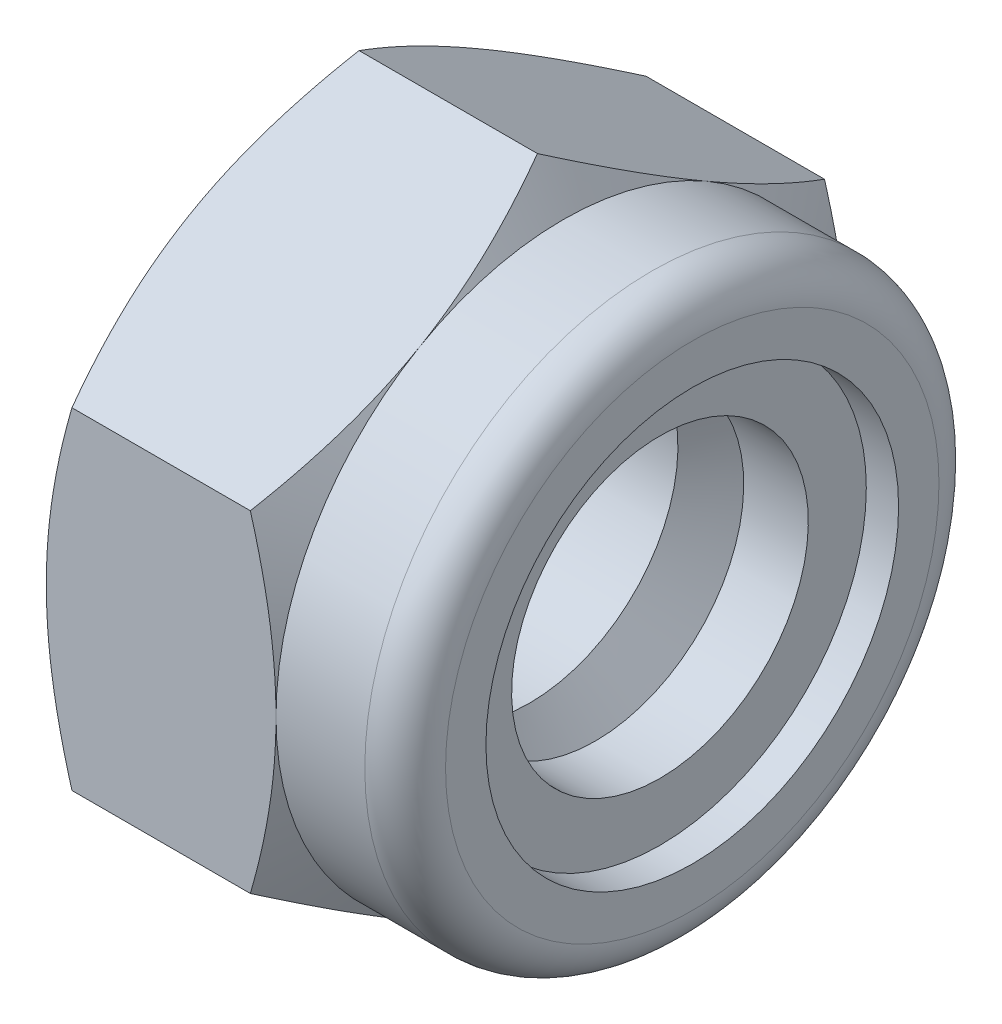
ISO-10303-21;
HEADER;
FILE_DESCRIPTION(('STEP AP214'),'2;1');
FILE_NAME('part.step','',(''),(''),'','','');
FILE_SCHEMA(('AUTOMOTIVE_DESIGN { 1 0 10303 214 1 1 1 1 }'));
ENDSEC;
DATA;
#1=APPLICATION_CONTEXT('core data for automotive mechanical design processes');
#2=APPLICATION_PROTOCOL_DEFINITION('international standard','automotive_design',2000,#1);
#3=PRODUCT_CONTEXT('',#1,'mechanical');
#4=PRODUCT('Part','Part','',(#3));
#5=PRODUCT_RELATED_PRODUCT_CATEGORY('part','',(#4));
#6=PRODUCT_DEFINITION_FORMATION('','',#4);
#7=PRODUCT_DEFINITION_CONTEXT('part definition',#1,'design');
#8=PRODUCT_DEFINITION('design','',#6,#7);
#9=PRODUCT_DEFINITION_SHAPE('','',#8);
#10=(LENGTH_UNIT() NAMED_UNIT(*) SI_UNIT(.MILLI.,.METRE.));
#11=(NAMED_UNIT(*) PLANE_ANGLE_UNIT() SI_UNIT($,.RADIAN.));
#12=(NAMED_UNIT(*) SI_UNIT($,.STERADIAN.) SOLID_ANGLE_UNIT());
#13=UNCERTAINTY_MEASURE_WITH_UNIT(LENGTH_MEASURE(1.E-05),#10,'distance_accuracy_value','');
#14=(GEOMETRIC_REPRESENTATION_CONTEXT(3) GLOBAL_UNCERTAINTY_ASSIGNED_CONTEXT((#13)) GLOBAL_UNIT_ASSIGNED_CONTEXT((#10,
#11,#12)) REPRESENTATION_CONTEXT('',''));
#15=CARTESIAN_POINT('',(0.,0.,0.));
#16=DIRECTION('',(0.,0.,1.));
#17=DIRECTION('',(1.,0.,0.));
#18=AXIS2_PLACEMENT_3D('',#15,#16,#17);
#19=CARTESIAN_POINT('',(0.,3.4375,0.));
#20=DIRECTION('',(-1.,0.,0.));
#21=DIRECTION('',(0.,0.,1.));
#22=AXIS2_PLACEMENT_3D('',#19,#20,#21);
#23=PLANE('',#22);
#24=CARTESIAN_POINT('',(0.,0.,0.));
#25=DIRECTION('',(-1.,0.,0.));
#26=DIRECTION('',(0.,-1.,0.));
#27=AXIS2_PLACEMENT_3D('',#24,#25,#26);
#28=CIRCLE('',#27,2.875);
#29=CARTESIAN_POINT('',(0.,-2.875,0.));
#30=VERTEX_POINT('',#29);
#31=EDGE_CURVE('E677',#30,#30,#28,.F.);
#32=ORIENTED_EDGE('',*,*,#31,.T.);
#33=EDGE_LOOP('',(#32));
#34=FACE_BOUND('',#33,.T.);
#35=CARTESIAN_POINT('',(0.,0.,0.));
#36=DIRECTION('',(-1.,0.,0.));
#37=DIRECTION('',(0.,1.,0.));
#38=AXIS2_PLACEMENT_3D('',#35,#36,#37);
#39=CIRCLE('',#38,4.);
#40=CARTESIAN_POINT('',(0.,3.46410161513775,2.));
#41=VERTEX_POINT('',#40);
#42=CARTESIAN_POINT('',(0.,3.46410161513775,-2.));
#43=VERTEX_POINT('',#42);
#44=EDGE_CURVE('E155',#41,#43,#39,.T.);
#45=ORIENTED_EDGE('',*,*,#44,.T.);
#46=CARTESIAN_POINT('',(0.,0.,0.));
#47=DIRECTION('',(-1.,0.,0.));
#48=DIRECTION('',(0.,1.,0.));
#49=AXIS2_PLACEMENT_3D('',#46,#47,#48);
#50=CIRCLE('',#49,4.);
#51=CARTESIAN_POINT('',(0.,0.,-4.));
#52=VERTEX_POINT('',#51);
#53=EDGE_CURVE('E270',#43,#52,#50,.T.);
#54=ORIENTED_EDGE('',*,*,#53,.T.);
#55=CARTESIAN_POINT('',(0.,0.,0.));
#56=DIRECTION('',(-1.,0.,0.));
#57=DIRECTION('',(0.,1.,0.));
#58=AXIS2_PLACEMENT_3D('',#55,#56,#57);
#59=CIRCLE('',#58,4.);
#60=CARTESIAN_POINT('',(0.,-3.46410161513775,-2.));
#61=VERTEX_POINT('',#60);
#62=EDGE_CURVE('E102',#52,#61,#59,.T.);
#63=ORIENTED_EDGE('',*,*,#62,.T.);
#64=CARTESIAN_POINT('',(0.,0.,0.));
#65=DIRECTION('',(-1.,0.,0.));
#66=DIRECTION('',(0.,1.,0.));
#67=AXIS2_PLACEMENT_3D('',#64,#65,#66);
#68=CIRCLE('',#67,4.);
#69=CARTESIAN_POINT('',(0.,-3.46410161513775,2.));
#70=VERTEX_POINT('',#69);
#71=EDGE_CURVE('E148',#61,#70,#68,.T.);
#72=ORIENTED_EDGE('',*,*,#71,.T.);
#73=CARTESIAN_POINT('',(0.,0.,0.));
#74=DIRECTION('',(-1.,0.,0.));
#75=DIRECTION('',(0.,1.,0.));
#76=AXIS2_PLACEMENT_3D('',#73,#74,#75);
#77=CIRCLE('',#76,4.);
#78=CARTESIAN_POINT('',(0.,0.,4.));
#79=VERTEX_POINT('',#78);
#80=EDGE_CURVE('E295',#70,#79,#77,.T.);
#81=ORIENTED_EDGE('',*,*,#80,.T.);
#82=CARTESIAN_POINT('',(0.,0.,0.));
#83=DIRECTION('',(-1.,0.,0.));
#84=DIRECTION('',(0.,1.,0.));
#85=AXIS2_PLACEMENT_3D('',#82,#83,#84);
#86=CIRCLE('',#85,4.);
#87=EDGE_CURVE('E360',#79,#41,#86,.T.);
#88=ORIENTED_EDGE('',*,*,#87,.T.);
#89=EDGE_LOOP('',(#45,#54,#63,#72,#81,#88));
#90=FACE_BOUND('',#89,.T.);
#91=ADVANCED_FACE('F51',(#34,#90),#23,.T.);
#92=CARTESIAN_POINT('',(2.62264973081037,0.,0.));
#93=DIRECTION('',(-1.,0.,0.));
#94=DIRECTION('',(0.,1.,0.));
#95=AXIS2_PLACEMENT_3D('',#92,#93,#94);
#96=CONICAL_SURFACE('',#95,5.,1.0471975511966);
#97=CARTESIAN_POINT('',(3.2,0.,-4.));
#98=CARTESIAN_POINT('',(3.2,1.07179676972993,-4.));
#99=CARTESIAN_POINT('',(2.84273441009184,2.3094010767585,-4.));
#100=(BOUNDED_CURVE() B_SPLINE_CURVE(2,(#97,#98,#99),.UNSPECIFIED.,.F.,
.F.) B_SPLINE_CURVE_WITH_KNOTS((3,3),(4.64329131426913,7.29964950593824),
.UNSPECIFIED.) CURVE() GEOMETRIC_REPRESENTATION_ITEM() RATIONAL_B_SPLINE_CURVE((1.,
1.06752549682757,1.05779032035074)) REPRESENTATION_ITEM(''));
#101=CARTESIAN_POINT('',(3.2,0.,-4.));
#102=VERTEX_POINT('',#101);
#103=CARTESIAN_POINT('',(2.84273441009184,2.3094010767585,-4.));
#104=VERTEX_POINT('',#103);
#105=EDGE_CURVE('E314',#102,#104,#100,.T.);
#106=ORIENTED_EDGE('',*,*,#105,.T.);
#107=CARTESIAN_POINT('',(2.84273441009184,2.3094010767585,-4.));
#108=CARTESIAN_POINT('',(3.2,2.92820323027532,-2.92820323027584));
#109=CARTESIAN_POINT('',(3.2,3.46410161513775,-2.));
#110=(BOUNDED_CURVE() B_SPLINE_CURVE(2,(#107,#108,#109),.UNSPECIFIED.,.F.,
.F.) B_SPLINE_CURVE_WITH_KNOTS((3,3),(1.98693312261341,4.64329131426913),
.UNSPECIFIED.) CURVE() GEOMETRIC_REPRESENTATION_ITEM() RATIONAL_B_SPLINE_CURVE((1.05779032035084,
1.06752549682723,1.)) REPRESENTATION_ITEM(''));
#111=CARTESIAN_POINT('',(3.2,3.46410161513775,-2.));
#112=VERTEX_POINT('',#111);
#113=EDGE_CURVE('E434',#104,#112,#110,.T.);
#114=ORIENTED_EDGE('',*,*,#113,.T.);
#115=CARTESIAN_POINT('',(3.2,0.,0.));
#116=DIRECTION('',(-1.,0.,0.));
#117=DIRECTION('',(0.,1.,0.));
#118=AXIS2_PLACEMENT_3D('',#115,#116,#117);
#119=CIRCLE('',#118,4.);
#120=EDGE_CURVE('E206',#112,#102,#119,.T.);
#121=ORIENTED_EDGE('',*,*,#120,.T.);
#122=EDGE_LOOP('',(#106,#114,#121));
#123=FACE_BOUND('',#122,.T.);
#124=ADVANCED_FACE('F623',(#123),#96,.T.);
#125=CARTESIAN_POINT('',(2.62264973081037,0.,0.));
#126=DIRECTION('',(-1.,0.,0.));
#127=DIRECTION('',(0.,1.,0.));
#128=AXIS2_PLACEMENT_3D('',#125,#126,#127);
#129=CONICAL_SURFACE('',#128,5.,1.0471975511966);
#130=CARTESIAN_POINT('',(3.2,-3.46410161513775,-2.));
#131=CARTESIAN_POINT('',(3.2,-2.92820323027279,-2.92820323028022));
#132=CARTESIAN_POINT('',(2.84273441009184,-2.3094010767585,-4.));
#133=(BOUNDED_CURVE() B_SPLINE_CURVE(2,(#130,#131,#132),.UNSPECIFIED.,.F.,
.F.) B_SPLINE_CURVE_WITH_KNOTS((3,3),(4.64329131426913,7.29964950593824),
.UNSPECIFIED.) CURVE() GEOMETRIC_REPRESENTATION_ITEM() RATIONAL_B_SPLINE_CURVE((1.,
1.06752549682756,1.05779032035074)) REPRESENTATION_ITEM(''));
#134=CARTESIAN_POINT('',(3.2,-3.46410161513775,-2.));
#135=VERTEX_POINT('',#134);
#136=CARTESIAN_POINT('',(2.84273441009184,-2.3094010767585,-4.));
#137=VERTEX_POINT('',#136);
#138=EDGE_CURVE('E68',#135,#137,#133,.T.);
#139=ORIENTED_EDGE('',*,*,#138,.T.);
#140=CARTESIAN_POINT('',(2.84273441009184,-2.3094010767585,-4.));
#141=CARTESIAN_POINT('',(3.2,-1.07179676972487,-4.));
#142=CARTESIAN_POINT('',(3.2,0.,-4.));
#143=(BOUNDED_CURVE() B_SPLINE_CURVE(2,(#140,#141,#142),.UNSPECIFIED.,.F.,
.F.) B_SPLINE_CURVE_WITH_KNOTS((3,3),(1.98693312261341,4.64329131426913),
.UNSPECIFIED.) CURVE() GEOMETRIC_REPRESENTATION_ITEM() RATIONAL_B_SPLINE_CURVE((1.05779032035084,
1.06752549682723,1.)) REPRESENTATION_ITEM(''));
#144=EDGE_CURVE('E209',#137,#102,#143,.T.);
#145=ORIENTED_EDGE('',*,*,#144,.T.);
#146=CARTESIAN_POINT('',(3.2,0.,0.));
#147=DIRECTION('',(-1.,0.,0.));
#148=DIRECTION('',(0.,1.,0.));
#149=AXIS2_PLACEMENT_3D('',#146,#147,#148);
#150=CIRCLE('',#149,4.);
#151=EDGE_CURVE('E199',#102,#135,#150,.T.);
#152=ORIENTED_EDGE('',*,*,#151,.T.);
#153=EDGE_LOOP('',(#139,#145,#152));
#154=FACE_BOUND('',#153,.T.);
#155=ADVANCED_FACE('F629',(#154),#129,.T.);
#156=CARTESIAN_POINT('',(2.62264973081037,0.,0.));
#157=DIRECTION('',(-1.,0.,0.));
#158=DIRECTION('',(0.,1.,0.));
#159=AXIS2_PLACEMENT_3D('',#156,#157,#158);
#160=CONICAL_SURFACE('',#159,5.,1.0471975511966);
#161=CARTESIAN_POINT('',(2.84273441009184,-2.3094010767585,4.));
#162=CARTESIAN_POINT('',(3.2,-2.92820323027532,2.92820323027584));
#163=CARTESIAN_POINT('',(3.2,-3.46410161513775,2.));
#164=(BOUNDED_CURVE() B_SPLINE_CURVE(2,(#161,#162,#163),.UNSPECIFIED.,.F.,
.F.) B_SPLINE_CURVE_WITH_KNOTS((3,3),(1.9869331226134,4.64329131426913),
.UNSPECIFIED.) CURVE() GEOMETRIC_REPRESENTATION_ITEM() RATIONAL_B_SPLINE_CURVE((1.05779032035084,
1.06752549682723,1.)) REPRESENTATION_ITEM(''));
#165=CARTESIAN_POINT('',(2.84273441009184,-2.3094010767585,4.));
#166=VERTEX_POINT('',#165);
#167=CARTESIAN_POINT('',(3.2,-3.46410161513775,2.));
#168=VERTEX_POINT('',#167);
#169=EDGE_CURVE('E147',#166,#168,#164,.T.);
#170=ORIENTED_EDGE('',*,*,#169,.T.);
#171=CARTESIAN_POINT('',(3.2,0.,0.));
#172=DIRECTION('',(-1.,0.,0.));
#173=DIRECTION('',(0.,1.,0.));
#174=AXIS2_PLACEMENT_3D('',#171,#172,#173);
#175=CIRCLE('',#174,4.);
#176=CARTESIAN_POINT('',(3.2,0.,4.));
#177=VERTEX_POINT('',#176);
#178=EDGE_CURVE('E224',#168,#177,#175,.T.);
#179=ORIENTED_EDGE('',*,*,#178,.T.);
#180=CARTESIAN_POINT('',(3.2,0.,4.));
#181=CARTESIAN_POINT('',(3.2,-1.07179676972993,4.));
#182=CARTESIAN_POINT('',(2.84273441009184,-2.3094010767585,4.));
#183=(BOUNDED_CURVE() B_SPLINE_CURVE(2,(#180,#181,#182),.UNSPECIFIED.,.F.,
.F.) B_SPLINE_CURVE_WITH_KNOTS((3,3),(4.64329131426913,7.29964950593824),
.UNSPECIFIED.) CURVE() GEOMETRIC_REPRESENTATION_ITEM() RATIONAL_B_SPLINE_CURVE((1.,
1.06752549682757,1.05779032035074)) REPRESENTATION_ITEM(''));
#184=EDGE_CURVE('E402',#177,#166,#183,.T.);
#185=ORIENTED_EDGE('',*,*,#184,.T.);
#186=EDGE_LOOP('',(#170,#179,#185));
#187=FACE_BOUND('',#186,.T.);
#188=ADVANCED_FACE('F500',(#187),#160,.T.);
#189=CARTESIAN_POINT('',(2.62264973081037,0.,0.));
#190=DIRECTION('',(-1.,0.,0.));
#191=DIRECTION('',(0.,1.,0.));
#192=AXIS2_PLACEMENT_3D('',#189,#190,#191);
#193=CONICAL_SURFACE('',#192,5.,1.0471975511966);
#194=CARTESIAN_POINT('',(2.84273441009184,2.3094010767585,4.));
#195=CARTESIAN_POINT('',(3.2,1.07179676972487,4.));
#196=CARTESIAN_POINT('',(3.2,0.,4.));
#197=(BOUNDED_CURVE() B_SPLINE_CURVE(2,(#194,#195,#196),.UNSPECIFIED.,.F.,
.F.) B_SPLINE_CURVE_WITH_KNOTS((3,3),(1.98693312261341,4.64329131426913),
.UNSPECIFIED.) CURVE() GEOMETRIC_REPRESENTATION_ITEM() RATIONAL_B_SPLINE_CURVE((1.05779032035084,
1.06752549682723,1.)) REPRESENTATION_ITEM(''));
#198=CARTESIAN_POINT('',(2.84273441009184,2.3094010767585,4.));
#199=VERTEX_POINT('',#198);
#200=EDGE_CURVE('E324',#199,#177,#197,.T.);
#201=ORIENTED_EDGE('',*,*,#200,.T.);
#202=CARTESIAN_POINT('',(3.2,0.,0.));
#203=DIRECTION('',(-1.,0.,0.));
#204=DIRECTION('',(0.,1.,0.));
#205=AXIS2_PLACEMENT_3D('',#202,#203,#204);
#206=CIRCLE('',#205,4.);
#207=CARTESIAN_POINT('',(3.2,3.46410161513775,2.));
#208=VERTEX_POINT('',#207);
#209=EDGE_CURVE('E491',#177,#208,#206,.T.);
#210=ORIENTED_EDGE('',*,*,#209,.T.);
#211=CARTESIAN_POINT('',(3.2,3.46410161513775,2.));
#212=CARTESIAN_POINT('',(3.2,2.92820323027279,2.92820323028022));
#213=CARTESIAN_POINT('',(2.84273441009184,2.3094010767585,4.));
#214=(BOUNDED_CURVE() B_SPLINE_CURVE(2,(#211,#212,#213),.UNSPECIFIED.,.F.,
.F.) B_SPLINE_CURVE_WITH_KNOTS((3,3),(4.64329131426913,7.29964950593824),
.UNSPECIFIED.) CURVE() GEOMETRIC_REPRESENTATION_ITEM() RATIONAL_B_SPLINE_CURVE((1.,
1.06752549682757,1.05779032035074)) REPRESENTATION_ITEM(''));
#215=EDGE_CURVE('E332',#208,#199,#214,.T.);
#216=ORIENTED_EDGE('',*,*,#215,.T.);
#217=EDGE_LOOP('',(#201,#210,#216));
#218=FACE_BOUND('',#217,.T.);
#219=ADVANCED_FACE('F488',(#218),#193,.T.);
#220=CARTESIAN_POINT('',(0.577350269189626,0.,0.));
#221=DIRECTION('',(1.,0.,0.));
#222=DIRECTION('',(0.,1.,0.));
#223=AXIS2_PLACEMENT_3D('',#220,#221,#222);
#224=CONICAL_SURFACE('',#223,5.,1.0471975511966);
#225=CARTESIAN_POINT('',(0.,0.,4.));
#226=CARTESIAN_POINT('',(0.,1.07179676972993,4.));
#227=CARTESIAN_POINT('',(0.357265589908163,2.3094010767585,4.));
#228=(BOUNDED_CURVE() B_SPLINE_CURVE(2,(#225,#226,#227),.UNSPECIFIED.,.F.,
.F.) B_SPLINE_CURVE_WITH_KNOTS((3,3),(4.64329131426913,7.29964950593824),
.UNSPECIFIED.) CURVE() GEOMETRIC_REPRESENTATION_ITEM() RATIONAL_B_SPLINE_CURVE((1.,
1.06752549682757,1.05779032035074)) REPRESENTATION_ITEM(''));
#229=CARTESIAN_POINT('',(0.357265589908163,2.3094010767585,4.));
#230=VERTEX_POINT('',#229);
#231=EDGE_CURVE('E323',#79,#230,#228,.T.);
#232=ORIENTED_EDGE('',*,*,#231,.T.);
#233=CARTESIAN_POINT('',(0.357265589908163,2.3094010767585,4.));
#234=CARTESIAN_POINT('',(0.,2.92820323027532,2.92820323027584));
#235=CARTESIAN_POINT('',(0.,3.46410161513775,2.));
#236=(BOUNDED_CURVE() B_SPLINE_CURVE(2,(#233,#234,#235),.UNSPECIFIED.,.F.,
.F.) B_SPLINE_CURVE_WITH_KNOTS((3,3),(1.9869331226134,4.64329131426913),
.UNSPECIFIED.) CURVE() GEOMETRIC_REPRESENTATION_ITEM() RATIONAL_B_SPLINE_CURVE((1.05779032035084,
1.06752549682723,1.)) REPRESENTATION_ITEM(''));
#237=EDGE_CURVE('E325',#230,#41,#236,.T.);
#238=ORIENTED_EDGE('',*,*,#237,.T.);
#239=ORIENTED_EDGE('',*,*,#87,.F.);
#240=EDGE_LOOP('',(#232,#238,#239));
#241=FACE_BOUND('',#240,.T.);
#242=ADVANCED_FACE('F609',(#241),#224,.T.);
#243=CARTESIAN_POINT('',(0.577350269189626,0.,0.));
#244=DIRECTION('',(1.,0.,0.));
#245=DIRECTION('',(0.,1.,0.));
#246=AXIS2_PLACEMENT_3D('',#243,#244,#245);
#247=CONICAL_SURFACE('',#246,5.,1.0471975511966);
#248=CARTESIAN_POINT('',(0.,-3.46410161513775,2.));
#249=CARTESIAN_POINT('',(0.,-2.92820323027279,2.92820323028022));
#250=CARTESIAN_POINT('',(0.357265589908163,-2.3094010767585,4.));
#251=(BOUNDED_CURVE() B_SPLINE_CURVE(2,(#248,#249,#250),.UNSPECIFIED.,.F.,
.F.) B_SPLINE_CURVE_WITH_KNOTS((3,3),(4.64329131426913,7.29964950593824),
.UNSPECIFIED.) CURVE() GEOMETRIC_REPRESENTATION_ITEM() RATIONAL_B_SPLINE_CURVE((1.,
1.06752549682757,1.05779032035074)) REPRESENTATION_ITEM(''));
#252=CARTESIAN_POINT('',(0.357265589908163,-2.3094010767585,4.));
#253=VERTEX_POINT('',#252);
#254=EDGE_CURVE('E275',#70,#253,#251,.T.);
#255=ORIENTED_EDGE('',*,*,#254,.T.);
#256=CARTESIAN_POINT('',(0.357265589908163,-2.3094010767585,4.));
#257=CARTESIAN_POINT('',(0.,-1.07179676972487,4.));
#258=CARTESIAN_POINT('',(0.,0.,4.));
#259=(BOUNDED_CURVE() B_SPLINE_CURVE(2,(#256,#257,#258),.UNSPECIFIED.,.F.,
.F.) B_SPLINE_CURVE_WITH_KNOTS((3,3),(1.98693312261341,4.64329131426913),
.UNSPECIFIED.) CURVE() GEOMETRIC_REPRESENTATION_ITEM() RATIONAL_B_SPLINE_CURVE((1.05779032035084,
1.06752549682723,1.)) REPRESENTATION_ITEM(''));
#260=EDGE_CURVE('E392',#253,#79,#259,.T.);
#261=ORIENTED_EDGE('',*,*,#260,.T.);
#262=ORIENTED_EDGE('',*,*,#80,.F.);
#263=EDGE_LOOP('',(#255,#261,#262));
#264=FACE_BOUND('',#263,.T.);
#265=ADVANCED_FACE('F644',(#264),#247,.T.);
#266=CARTESIAN_POINT('',(0.577350269189626,0.,0.));
#267=DIRECTION('',(1.,0.,0.));
#268=DIRECTION('',(0.,1.,0.));
#269=AXIS2_PLACEMENT_3D('',#266,#267,#268);
#270=CONICAL_SURFACE('',#269,5.,1.0471975511966);
#271=CARTESIAN_POINT('',(0.357265589908163,-2.3094010767585,-4.));
#272=CARTESIAN_POINT('',(0.,-2.92820323027532,-2.92820323027584));
#273=CARTESIAN_POINT('',(0.,-3.46410161513775,-2.));
#274=(BOUNDED_CURVE() B_SPLINE_CURVE(2,(#271,#272,#273),.UNSPECIFIED.,.F.,
.F.) B_SPLINE_CURVE_WITH_KNOTS((3,3),(1.98693312261341,4.64329131426913),
.UNSPECIFIED.) CURVE() GEOMETRIC_REPRESENTATION_ITEM() RATIONAL_B_SPLINE_CURVE((1.05779032035084,
1.06752549682723,1.)) REPRESENTATION_ITEM(''));
#275=CARTESIAN_POINT('',(0.357265589908163,-2.3094010767585,-4.));
#276=VERTEX_POINT('',#275);
#277=EDGE_CURVE('E385',#276,#61,#274,.T.);
#278=ORIENTED_EDGE('',*,*,#277,.T.);
#279=ORIENTED_EDGE('',*,*,#62,.F.);
#280=CARTESIAN_POINT('',(0.,0.,-4.));
#281=CARTESIAN_POINT('',(0.,-1.07179676972993,-4.));
#282=CARTESIAN_POINT('',(0.357265589908163,-2.3094010767585,-4.));
#283=(BOUNDED_CURVE() B_SPLINE_CURVE(2,(#280,#281,#282),.UNSPECIFIED.,.F.,
.F.) B_SPLINE_CURVE_WITH_KNOTS((3,3),(4.64329131426913,7.29964950593824),
.UNSPECIFIED.) CURVE() GEOMETRIC_REPRESENTATION_ITEM() RATIONAL_B_SPLINE_CURVE((1.,
1.06752549682757,1.05779032035074)) REPRESENTATION_ITEM(''));
#284=EDGE_CURVE('E315',#52,#276,#283,.T.);
#285=ORIENTED_EDGE('',*,*,#284,.T.);
#286=EDGE_LOOP('',(#278,#279,#285));
#287=FACE_BOUND('',#286,.T.);
#288=ADVANCED_FACE('F647',(#287),#270,.T.);
#289=CARTESIAN_POINT('',(0.577350269189626,0.,0.));
#290=DIRECTION('',(1.,0.,0.));
#291=DIRECTION('',(0.,1.,0.));
#292=AXIS2_PLACEMENT_3D('',#289,#290,#291);
#293=CONICAL_SURFACE('',#292,5.,1.0471975511966);
#294=CARTESIAN_POINT('',(0.357265589908163,2.3094010767585,-4.));
#295=CARTESIAN_POINT('',(0.,1.07179676972487,-4.));
#296=CARTESIAN_POINT('',(0.,0.,-4.));
#297=(BOUNDED_CURVE() B_SPLINE_CURVE(2,(#294,#295,#296),.UNSPECIFIED.,.F.,
.F.) B_SPLINE_CURVE_WITH_KNOTS((3,3),(1.98693312261341,4.64329131426913),
.UNSPECIFIED.) CURVE() GEOMETRIC_REPRESENTATION_ITEM() RATIONAL_B_SPLINE_CURVE((1.05779032035084,
1.06752549682723,1.)) REPRESENTATION_ITEM(''));
#298=CARTESIAN_POINT('',(0.357265589908163,2.3094010767585,-4.));
#299=VERTEX_POINT('',#298);
#300=EDGE_CURVE('E307',#299,#52,#297,.T.);
#301=ORIENTED_EDGE('',*,*,#300,.T.);
#302=ORIENTED_EDGE('',*,*,#53,.F.);
#303=CARTESIAN_POINT('',(0.,3.46410161513775,-2.));
#304=CARTESIAN_POINT('',(0.,2.92820323027279,-2.92820323028022));
#305=CARTESIAN_POINT('',(0.357265589908163,2.3094010767585,-4.));
#306=(BOUNDED_CURVE() B_SPLINE_CURVE(2,(#303,#304,#305),.UNSPECIFIED.,.F.,
.F.) B_SPLINE_CURVE_WITH_KNOTS((3,3),(4.64329131426913,7.29964950593824),
.UNSPECIFIED.) CURVE() GEOMETRIC_REPRESENTATION_ITEM() RATIONAL_B_SPLINE_CURVE((1.,
1.06752549682757,1.05779032035075)) REPRESENTATION_ITEM(''));
#307=EDGE_CURVE('E333',#43,#299,#306,.T.);
#308=ORIENTED_EDGE('',*,*,#307,.T.);
#309=EDGE_LOOP('',(#301,#302,#308));
#310=FACE_BOUND('',#309,.T.);
#311=ADVANCED_FACE('F643',(#310),#293,.T.);
#312=CARTESIAN_POINT('',(6.,-2.3094010767585,-4.));
#313=DIRECTION('',(0.,0.866025403784439,0.5));
#314=DIRECTION('',(1.,0.,0.));
#315=AXIS2_PLACEMENT_3D('',#312,#313,#314);
#316=PLANE('',#315);
#317=CARTESIAN_POINT('',(0.,-3.46410161513775,-2.));
#318=CARTESIAN_POINT('',(0.,-4.00000000000272,-1.07179676971978));
#319=CARTESIAN_POINT('',(0.357265589908163,-4.61880215351701,0.));
#320=(BOUNDED_CURVE() B_SPLINE_CURVE(2,(#317,#318,#319),.UNSPECIFIED.,.F.,
.F.) B_SPLINE_CURVE_WITH_KNOTS((3,3),(4.64329131426913,7.29964950593824),
.UNSPECIFIED.) CURVE() GEOMETRIC_REPRESENTATION_ITEM() RATIONAL_B_SPLINE_CURVE((1.,
1.06752549682757,1.05779032035074)) REPRESENTATION_ITEM(''));
#321=CARTESIAN_POINT('',(0.357265589908163,-4.61880215351701,0.));
#322=VERTEX_POINT('',#321);
#323=EDGE_CURVE('E381',#61,#322,#320,.T.);
#324=ORIENTED_EDGE('',*,*,#323,.F.);
#325=ORIENTED_EDGE('',*,*,#277,.F.);
#326=DIRECTION('',(-1.,0.,0.));
#327=VECTOR('',#326,1.);
#328=CARTESIAN_POINT('',(6.,-2.3094010767585,-4.));
#329=LINE('',#328,#327);
#330=EDGE_CURVE('E391',#137,#276,#329,.T.);
#331=ORIENTED_EDGE('',*,*,#330,.F.);
#332=ORIENTED_EDGE('',*,*,#138,.F.);
#333=CARTESIAN_POINT('',(2.84273441009184,-4.61880215351701,0.));
#334=CARTESIAN_POINT('',(3.2,-4.00000000000019,-1.07179676972416));
#335=CARTESIAN_POINT('',(3.2,-3.46410161513775,-2.));
#336=(BOUNDED_CURVE() B_SPLINE_CURVE(2,(#333,#334,#335),.UNSPECIFIED.,.F.,
.F.) B_SPLINE_CURVE_WITH_KNOTS((3,3),(1.9869331226134,4.64329131426913),
.UNSPECIFIED.) CURVE() GEOMETRIC_REPRESENTATION_ITEM() RATIONAL_B_SPLINE_CURVE((1.05779032035084,
1.06752549682723,1.)) REPRESENTATION_ITEM(''));
#337=CARTESIAN_POINT('',(2.84273441009184,-4.61880215351701,0.));
#338=VERTEX_POINT('',#337);
#339=EDGE_CURVE('E151',#338,#135,#336,.T.);
#340=ORIENTED_EDGE('',*,*,#339,.F.);
#341=DIRECTION('',(-1.,0.,0.));
#342=VECTOR('',#341,1.);
#343=CARTESIAN_POINT('',(6.,-4.61880215351701,0.));
#344=LINE('',#343,#342);
#345=EDGE_CURVE('E132',#338,#322,#344,.T.);
#346=ORIENTED_EDGE('',*,*,#345,.T.);
#347=EDGE_LOOP('',(#324,#325,#331,#332,#340,#346));
#348=FACE_BOUND('',#347,.T.);
#349=ADVANCED_FACE('F152',(#348),#316,.F.);
#350=CARTESIAN_POINT('',(6.,2.3094010767585,-4.));
#351=DIRECTION('',(0.,0.,1.));
#352=DIRECTION('',(1.,0.,0.));
#353=AXIS2_PLACEMENT_3D('',#350,#351,#352);
#354=PLANE('',#353);
#355=ORIENTED_EDGE('',*,*,#284,.F.);
#356=ORIENTED_EDGE('',*,*,#300,.F.);
#357=DIRECTION('',(-1.,0.,0.));
#358=VECTOR('',#357,1.);
#359=CARTESIAN_POINT('',(6.,2.3094010767585,-4.));
#360=LINE('',#359,#358);
#361=EDGE_CURVE('E578',#104,#299,#360,.T.);
#362=ORIENTED_EDGE('',*,*,#361,.F.);
#363=ORIENTED_EDGE('',*,*,#105,.F.);
#364=ORIENTED_EDGE('',*,*,#144,.F.);
#365=ORIENTED_EDGE('',*,*,#330,.T.);
#366=EDGE_LOOP('',(#355,#356,#362,#363,#364,#365));
#367=FACE_BOUND('',#366,.T.);
#368=ADVANCED_FACE('F619',(#367),#354,.F.);
#369=CARTESIAN_POINT('',(6.,4.61880215351701,0.));
#370=DIRECTION('',(0.,-0.866025403784439,0.5));
#371=DIRECTION('',(-1.,0.,0.));
#372=AXIS2_PLACEMENT_3D('',#369,#370,#371);
#373=PLANE('',#372);
#374=ORIENTED_EDGE('',*,*,#307,.F.);
#375=CARTESIAN_POINT('',(0.357265589908163,4.61880215351701,0.));
#376=CARTESIAN_POINT('',(0.,4.00000000000019,-1.07179676972416));
#377=CARTESIAN_POINT('',(0.,3.46410161513775,-2.));
#378=(BOUNDED_CURVE() B_SPLINE_CURVE(2,(#375,#376,#377),.UNSPECIFIED.,.F.,
.F.) B_SPLINE_CURVE_WITH_KNOTS((3,3),(1.9869331226134,4.64329131426913),
.UNSPECIFIED.) CURVE() GEOMETRIC_REPRESENTATION_ITEM() RATIONAL_B_SPLINE_CURVE((1.05779032035084,
1.06752549682723,1.)) REPRESENTATION_ITEM(''));
#379=CARTESIAN_POINT('',(0.357265589908163,4.61880215351701,0.));
#380=VERTEX_POINT('',#379);
#381=EDGE_CURVE('E280',#380,#43,#378,.T.);
#382=ORIENTED_EDGE('',*,*,#381,.F.);
#383=DIRECTION('',(-1.,0.,0.));
#384=VECTOR('',#383,1.);
#385=CARTESIAN_POINT('',(6.,4.61880215351701,0.));
#386=LINE('',#385,#384);
#387=CARTESIAN_POINT('',(2.84273441009184,4.61880215351701,0.));
#388=VERTEX_POINT('',#387);
#389=EDGE_CURVE('E110',#388,#380,#386,.T.);
#390=ORIENTED_EDGE('',*,*,#389,.F.);
#391=CARTESIAN_POINT('',(3.2,3.46410161513775,-2.));
#392=CARTESIAN_POINT('',(3.2,4.00000000000272,-1.07179676971978));
#393=CARTESIAN_POINT('',(2.84273441009184,4.61880215351701,0.));
#394=(BOUNDED_CURVE() B_SPLINE_CURVE(2,(#391,#392,#393),.UNSPECIFIED.,.F.,
.F.) B_SPLINE_CURVE_WITH_KNOTS((3,3),(4.64329131426913,7.29964950593824),
.UNSPECIFIED.) CURVE() GEOMETRIC_REPRESENTATION_ITEM() RATIONAL_B_SPLINE_CURVE((1.,
1.06752549682757,1.05779032035074)) REPRESENTATION_ITEM(''));
#395=EDGE_CURVE('E167',#112,#388,#394,.T.);
#396=ORIENTED_EDGE('',*,*,#395,.F.);
#397=ORIENTED_EDGE('',*,*,#113,.F.);
#398=ORIENTED_EDGE('',*,*,#361,.T.);
#399=EDGE_LOOP('',(#374,#382,#390,#396,#397,#398));
#400=FACE_BOUND('',#399,.T.);
#401=ADVANCED_FACE('F612',(#400),#373,.F.);
#402=CARTESIAN_POINT('',(6.,2.3094010767585,4.));
#403=DIRECTION('',(0.,-0.866025403784439,-0.5));
#404=DIRECTION('',(0.,0.5,-0.866025403784439));
#405=AXIS2_PLACEMENT_3D('',#402,#403,#404);
#406=PLANE('',#405);
#407=ORIENTED_EDGE('',*,*,#237,.F.);
#408=DIRECTION('',(-1.,0.,0.));
#409=VECTOR('',#408,1.);
#410=CARTESIAN_POINT('',(6.,2.3094010767585,4.));
#411=LINE('',#410,#409);
#412=EDGE_CURVE('E316',#199,#230,#411,.T.);
#413=ORIENTED_EDGE('',*,*,#412,.F.);
#414=ORIENTED_EDGE('',*,*,#215,.F.);
#415=CARTESIAN_POINT('',(2.84273441009184,4.61880215351701,0.));
#416=CARTESIAN_POINT('',(3.2,4.00000000000019,1.07179676972416));
#417=CARTESIAN_POINT('',(3.2,3.46410161513775,2.));
#418=(BOUNDED_CURVE() B_SPLINE_CURVE(2,(#415,#416,#417),.UNSPECIFIED.,.F.,
.F.) B_SPLINE_CURVE_WITH_KNOTS((3,3),(1.9869331226134,4.64329131426913),
.UNSPECIFIED.) CURVE() GEOMETRIC_REPRESENTATION_ITEM() RATIONAL_B_SPLINE_CURVE((1.05779032035084,
1.06752549682723,1.)) REPRESENTATION_ITEM(''));
#419=EDGE_CURVE('E161',#388,#208,#418,.T.);
#420=ORIENTED_EDGE('',*,*,#419,.F.);
#421=ORIENTED_EDGE('',*,*,#389,.T.);
#422=CARTESIAN_POINT('',(0.,3.46410161513775,2.));
#423=CARTESIAN_POINT('',(0.,4.00000000000272,1.07179676971978));
#424=CARTESIAN_POINT('',(0.357265589908163,4.61880215351701,0.));
#425=(BOUNDED_CURVE() B_SPLINE_CURVE(2,(#422,#423,#424),.UNSPECIFIED.,.F.,
.F.) B_SPLINE_CURVE_WITH_KNOTS((3,3),(4.64329131426913,7.29964950593823),
.UNSPECIFIED.) CURVE() GEOMETRIC_REPRESENTATION_ITEM() RATIONAL_B_SPLINE_CURVE((1.,
1.06752549682757,1.05779032035074)) REPRESENTATION_ITEM(''));
#426=EDGE_CURVE('E294',#41,#380,#425,.T.);
#427=ORIENTED_EDGE('',*,*,#426,.F.);
#428=EDGE_LOOP('',(#407,#413,#414,#420,#421,#427));
#429=FACE_BOUND('',#428,.T.);
#430=ADVANCED_FACE('F610',(#429),#406,.F.);
#431=CARTESIAN_POINT('',(6.,-2.3094010767585,4.));
#432=DIRECTION('',(0.,0.,-1.));
#433=DIRECTION('',(0.,-1.,0.));
#434=AXIS2_PLACEMENT_3D('',#431,#432,#433);
#435=PLANE('',#434);
#436=ORIENTED_EDGE('',*,*,#260,.F.);
#437=DIRECTION('',(-1.,0.,0.));
#438=VECTOR('',#437,1.);
#439=CARTESIAN_POINT('',(6.,-2.3094010767585,4.));
#440=LINE('',#439,#438);
#441=EDGE_CURVE('E498',#166,#253,#440,.T.);
#442=ORIENTED_EDGE('',*,*,#441,.F.);
#443=ORIENTED_EDGE('',*,*,#184,.F.);
#444=ORIENTED_EDGE('',*,*,#200,.F.);
#445=ORIENTED_EDGE('',*,*,#412,.T.);
#446=ORIENTED_EDGE('',*,*,#231,.F.);
#447=EDGE_LOOP('',(#436,#442,#443,#444,#445,#446));
#448=FACE_BOUND('',#447,.T.);
#449=ADVANCED_FACE('F496',(#448),#435,.F.);
#450=CARTESIAN_POINT('',(6.,-4.61880215351701,0.));
#451=DIRECTION('',(0.,0.866025403784439,-0.5));
#452=DIRECTION('',(-1.,0.,0.));
#453=AXIS2_PLACEMENT_3D('',#450,#451,#452);
#454=PLANE('',#453);
#455=CARTESIAN_POINT('',(0.357265589908163,-4.61880215351701,0.));
#456=CARTESIAN_POINT('',(0.,-4.00000000000019,1.07179676972416));
#457=CARTESIAN_POINT('',(0.,-3.46410161513775,2.));
#458=(BOUNDED_CURVE() B_SPLINE_CURVE(2,(#455,#456,#457),.UNSPECIFIED.,.F.,
.F.) B_SPLINE_CURVE_WITH_KNOTS((3,3),(1.98693312261341,4.64329131426913),
.UNSPECIFIED.) CURVE() GEOMETRIC_REPRESENTATION_ITEM() RATIONAL_B_SPLINE_CURVE((1.05779032035084,
1.06752549682723,1.)) REPRESENTATION_ITEM(''));
#459=EDGE_CURVE('E142',#322,#70,#458,.T.);
#460=ORIENTED_EDGE('',*,*,#459,.F.);
#461=ORIENTED_EDGE('',*,*,#345,.F.);
#462=CARTESIAN_POINT('',(3.2,-3.46410161513775,2.));
#463=CARTESIAN_POINT('',(3.2,-4.00000000000272,1.07179676971978));
#464=CARTESIAN_POINT('',(2.84273441009184,-4.61880215351701,0.));
#465=(BOUNDED_CURVE() B_SPLINE_CURVE(2,(#462,#463,#464),.UNSPECIFIED.,.F.,
.F.) B_SPLINE_CURVE_WITH_KNOTS((3,3),(4.64329131426913,7.29964950593824),
.UNSPECIFIED.) CURVE() GEOMETRIC_REPRESENTATION_ITEM() RATIONAL_B_SPLINE_CURVE((1.,
1.06752549682757,1.05779032035074)) REPRESENTATION_ITEM(''));
#466=EDGE_CURVE('E138',#168,#338,#465,.T.);
#467=ORIENTED_EDGE('',*,*,#466,.F.);
#468=ORIENTED_EDGE('',*,*,#169,.F.);
#469=ORIENTED_EDGE('',*,*,#441,.T.);
#470=ORIENTED_EDGE('',*,*,#254,.F.);
#471=EDGE_LOOP('',(#460,#461,#467,#468,#469,#470));
#472=FACE_BOUND('',#471,.T.);
#473=ADVANCED_FACE('F134',(#472),#454,.F.);
#474=CARTESIAN_POINT('',(0.577350269189626,0.,0.));
#475=DIRECTION('',(1.,0.,0.));
#476=DIRECTION('',(0.,1.,0.));
#477=AXIS2_PLACEMENT_3D('',#474,#475,#476);
#478=CONICAL_SURFACE('',#477,5.,1.0471975511966);
#479=ORIENTED_EDGE('',*,*,#323,.T.);
#480=ORIENTED_EDGE('',*,*,#459,.T.);
#481=ORIENTED_EDGE('',*,*,#71,.F.);
#482=EDGE_LOOP('',(#479,#480,#481));
#483=FACE_BOUND('',#482,.T.);
#484=ADVANCED_FACE('F640',(#483),#478,.T.);
#485=CARTESIAN_POINT('',(0.577350269189626,0.,0.));
#486=DIRECTION('',(1.,0.,0.));
#487=DIRECTION('',(0.,1.,0.));
#488=AXIS2_PLACEMENT_3D('',#485,#486,#487);
#489=CONICAL_SURFACE('',#488,5.,1.0471975511966);
#490=ORIENTED_EDGE('',*,*,#44,.F.);
#491=ORIENTED_EDGE('',*,*,#426,.T.);
#492=ORIENTED_EDGE('',*,*,#381,.T.);
#493=EDGE_LOOP('',(#490,#491,#492));
#494=FACE_BOUND('',#493,.T.);
#495=ADVANCED_FACE('F603',(#494),#489,.T.);
#496=CARTESIAN_POINT('',(2.62264973081037,0.,0.));
#497=DIRECTION('',(-1.,0.,0.));
#498=DIRECTION('',(0.,1.,0.));
#499=AXIS2_PLACEMENT_3D('',#496,#497,#498);
#500=CONICAL_SURFACE('',#499,5.,1.0471975511966);
#501=CARTESIAN_POINT('',(3.2,0.,0.));
#502=DIRECTION('',(-1.,0.,0.));
#503=DIRECTION('',(0.,1.,0.));
#504=AXIS2_PLACEMENT_3D('',#501,#502,#503);
#505=CIRCLE('',#504,4.);
#506=EDGE_CURVE('E159',#135,#168,#505,.T.);
#507=ORIENTED_EDGE('',*,*,#506,.T.);
#508=ORIENTED_EDGE('',*,*,#466,.T.);
#509=ORIENTED_EDGE('',*,*,#339,.T.);
#510=EDGE_LOOP('',(#507,#508,#509));
#511=FACE_BOUND('',#510,.T.);
#512=ADVANCED_FACE('F157',(#511),#500,.T.);
#513=CARTESIAN_POINT('',(2.62264973081037,0.,0.));
#514=DIRECTION('',(-1.,0.,0.));
#515=DIRECTION('',(0.,1.,0.));
#516=AXIS2_PLACEMENT_3D('',#513,#514,#515);
#517=CONICAL_SURFACE('',#516,5.,1.0471975511966);
#518=ORIENTED_EDGE('',*,*,#395,.T.);
#519=ORIENTED_EDGE('',*,*,#419,.T.);
#520=CARTESIAN_POINT('',(3.2,0.,0.));
#521=DIRECTION('',(-1.,0.,0.));
#522=DIRECTION('',(0.,1.,0.));
#523=AXIS2_PLACEMENT_3D('',#520,#521,#522);
#524=CIRCLE('',#523,4.);
#525=EDGE_CURVE('E446',#208,#112,#524,.T.);
#526=ORIENTED_EDGE('',*,*,#525,.T.);
#527=EDGE_LOOP('',(#518,#519,#526));
#528=FACE_BOUND('',#527,.T.);
#529=ADVANCED_FACE('F651',(#528),#517,.T.);
#530=CARTESIAN_POINT('',(5.,0.,0.));
#531=DIRECTION('',(-1.,0.,0.));
#532=DIRECTION('',(0.,0.,1.));
#533=AXIS2_PLACEMENT_3D('',#530,#531,#532);
#534=CYLINDRICAL_SURFACE('',#533,4.);
#535=CARTESIAN_POINT('',(4.4375,0.,0.));
#536=DIRECTION('',(1.,0.,0.));
#537=DIRECTION('',(0.,0.,-1.));
#538=AXIS2_PLACEMENT_3D('',#535,#536,#537);
#539=CIRCLE('',#538,4.);
#540=CARTESIAN_POINT('',(4.4375,0.,-4.));
#541=VERTEX_POINT('',#540);
#542=EDGE_CURVE('E12',#541,#541,#539,.F.);
#543=ORIENTED_EDGE('',*,*,#542,.T.);
#544=EDGE_LOOP('',(#543));
#545=FACE_BOUND('',#544,.T.);
#546=ORIENTED_EDGE('',*,*,#120,.F.);
#547=ORIENTED_EDGE('',*,*,#525,.F.);
#548=ORIENTED_EDGE('',*,*,#209,.F.);
#549=ORIENTED_EDGE('',*,*,#178,.F.);
#550=ORIENTED_EDGE('',*,*,#506,.F.);
#551=ORIENTED_EDGE('',*,*,#151,.F.);
#552=EDGE_LOOP('',(#546,#547,#548,#549,#550,#551));
#553=FACE_BOUND('',#552,.T.);
#554=ADVANCED_FACE('F654',(#545,#553),#534,.T.);
#555=CARTESIAN_POINT('',(5.,0.,0.));
#556=DIRECTION('',(1.,0.,0.));
#557=DIRECTION('',(0.,0.,-1.));
#558=AXIS2_PLACEMENT_3D('',#555,#556,#557);
#559=PLANE('',#558);
#560=CARTESIAN_POINT('',(5.,0.,0.));
#561=DIRECTION('',(1.,0.,0.));
#562=DIRECTION('',(0.,0.,-1.));
#563=AXIS2_PLACEMENT_3D('',#560,#561,#562);
#564=CIRCLE('',#563,3.4375);
#565=CARTESIAN_POINT('',(5.,0.,-3.4375));
#566=VERTEX_POINT('',#565);
#567=EDGE_CURVE('E60',#566,#566,#564,.T.);
#568=ORIENTED_EDGE('',*,*,#567,.T.);
#569=EDGE_LOOP('',(#568));
#570=FACE_BOUND('',#569,.T.);
#571=CARTESIAN_POINT('',(5.,0.,0.));
#572=DIRECTION('',(-1.,0.,0.));
#573=DIRECTION('',(0.,-1.,0.));
#574=AXIS2_PLACEMENT_3D('',#571,#572,#573);
#575=CIRCLE('',#574,2.875);
#576=CARTESIAN_POINT('',(5.,-2.875,0.));
#577=VERTEX_POINT('',#576);
#578=EDGE_CURVE('E408',#577,#577,#575,.T.);
#579=ORIENTED_EDGE('',*,*,#578,.T.);
#580=EDGE_LOOP('',(#579));
#581=FACE_BOUND('',#580,.T.);
#582=ADVANCED_FACE('F684',(#570,#581),#559,.T.);
#583=CARTESIAN_POINT('',(5.,0.,0.));
#584=DIRECTION('',(-1.,0.,0.));
#585=DIRECTION('',(0.,-1.,0.));
#586=AXIS2_PLACEMENT_3D('',#583,#584,#585);
#587=CYLINDRICAL_SURFACE('',#586,2.875);
#588=ORIENTED_EDGE('',*,*,#578,.F.);
#589=EDGE_LOOP('',(#588));
#590=FACE_BOUND('',#589,.T.);
#591=CARTESIAN_POINT('',(4.55,0.,0.));
#592=DIRECTION('',(-1.,0.,0.));
#593=DIRECTION('',(0.,-1.,0.));
#594=AXIS2_PLACEMENT_3D('',#591,#592,#593);
#595=CIRCLE('',#594,2.875);
#596=CARTESIAN_POINT('',(4.55,-2.875,0.));
#597=VERTEX_POINT('',#596);
#598=EDGE_CURVE('E768',#597,#597,#595,.T.);
#599=ORIENTED_EDGE('',*,*,#598,.T.);
#600=EDGE_LOOP('',(#599));
#601=FACE_BOUND('',#600,.T.);
#602=ADVANCED_FACE('F688',(#590,#601),#587,.F.);
#603=CARTESIAN_POINT('',(5.,0.,0.));
#604=DIRECTION('',(-1.,0.,0.));
#605=DIRECTION('',(0.,-1.,0.));
#606=AXIS2_PLACEMENT_3D('',#603,#604,#605);
#607=CYLINDRICAL_SURFACE('',#606,2.067);
#608=CARTESIAN_POINT('',(0.466499017505216,0.,0.));
#609=DIRECTION('',(-1.,0.,0.));
#610=DIRECTION('',(0.,-1.,0.));
#611=AXIS2_PLACEMENT_3D('',#608,#609,#610);
#612=CIRCLE('',#611,2.067);
#613=CARTESIAN_POINT('',(0.466499017505215,-2.067,0.));
#614=VERTEX_POINT('',#613);
#615=EDGE_CURVE('E179',#614,#614,#612,.T.);
#616=ORIENTED_EDGE('',*,*,#615,.T.);
#617=EDGE_LOOP('',(#616));
#618=FACE_BOUND('',#617,.T.);
#619=CARTESIAN_POINT('',(2.73350098249478,0.,0.));
#620=DIRECTION('',(-1.,0.,0.));
#621=DIRECTION('',(0.,-1.,0.));
#622=AXIS2_PLACEMENT_3D('',#619,#620,#621);
#623=CIRCLE('',#622,2.067);
#624=CARTESIAN_POINT('',(2.73350098249478,-2.067,0.));
#625=VERTEX_POINT('',#624);
#626=EDGE_CURVE('E693',#625,#625,#623,.T.);
#627=ORIENTED_EDGE('',*,*,#626,.F.);
#628=EDGE_LOOP('',(#627));
#629=FACE_BOUND('',#628,.T.);
#630=ADVANCED_FACE('F738',(#618,#629),#607,.F.);
#631=CARTESIAN_POINT('',(2.73350098249478,0.,0.));
#632=DIRECTION('',(1.,0.,0.));
#633=DIRECTION('',(0.,1.,0.));
#634=AXIS2_PLACEMENT_3D('',#631,#632,#633);
#635=CONICAL_SURFACE('',#634,2.067,1.04719755119659);
#636=CARTESIAN_POINT('',(3.2,0.,0.));
#637=DIRECTION('',(-1.,0.,0.));
#638=DIRECTION('',(0.,-1.,0.));
#639=AXIS2_PLACEMENT_3D('',#636,#637,#638);
#640=CIRCLE('',#639,2.875);
#641=CARTESIAN_POINT('',(3.2,-2.875,0.));
#642=VERTEX_POINT('',#641);
#643=EDGE_CURVE('E696',#642,#642,#640,.T.);
#644=ORIENTED_EDGE('',*,*,#643,.F.);
#645=EDGE_LOOP('',(#644));
#646=FACE_BOUND('',#645,.T.);
#647=ORIENTED_EDGE('',*,*,#626,.T.);
#648=EDGE_LOOP('',(#647));
#649=FACE_BOUND('',#648,.T.);
#650=ADVANCED_FACE('F741',(#646,#649),#635,.F.);
#651=CARTESIAN_POINT('',(5.,0.,0.));
#652=DIRECTION('',(-1.,0.,0.));
#653=DIRECTION('',(0.,-1.,0.));
#654=AXIS2_PLACEMENT_3D('',#651,#652,#653);
#655=CYLINDRICAL_SURFACE('',#654,2.875);
#656=CARTESIAN_POINT('',(3.65,0.,0.));
#657=DIRECTION('',(-1.,0.,0.));
#658=DIRECTION('',(0.,-1.,0.));
#659=AXIS2_PLACEMENT_3D('',#656,#657,#658);
#660=CIRCLE('',#659,2.875);
#661=CARTESIAN_POINT('',(3.65,-2.875,0.));
#662=VERTEX_POINT('',#661);
#663=EDGE_CURVE('E764',#662,#662,#660,.T.);
#664=ORIENTED_EDGE('',*,*,#663,.F.);
#665=EDGE_LOOP('',(#664));
#666=FACE_BOUND('',#665,.T.);
#667=ORIENTED_EDGE('',*,*,#643,.T.);
#668=EDGE_LOOP('',(#667));
#669=FACE_BOUND('',#668,.T.);
#670=ADVANCED_FACE('F744',(#666,#669),#655,.F.);
#671=CARTESIAN_POINT('',(3.65,2.875,0.));
#672=DIRECTION('',(1.,0.,0.));
#673=DIRECTION('',(0.,1.,0.));
#674=AXIS2_PLACEMENT_3D('',#671,#672,#673);
#675=PLANE('',#674);
#676=CARTESIAN_POINT('',(3.65,0.,0.));
#677=DIRECTION('',(-1.,0.,0.));
#678=DIRECTION('',(0.,-1.,0.));
#679=AXIS2_PLACEMENT_3D('',#676,#677,#678);
#680=CIRCLE('',#679,2.067);
#681=CARTESIAN_POINT('',(3.65,-2.067,0.));
#682=VERTEX_POINT('',#681);
#683=EDGE_CURVE('E763',#682,#682,#680,.T.);
#684=ORIENTED_EDGE('',*,*,#683,.F.);
#685=EDGE_LOOP('',(#684));
#686=FACE_BOUND('',#685,.T.);
#687=ORIENTED_EDGE('',*,*,#663,.T.);
#688=EDGE_LOOP('',(#687));
#689=FACE_BOUND('',#688,.T.);
#690=ADVANCED_FACE('F748',(#686,#689),#675,.F.);
#691=CARTESIAN_POINT('',(5.,0.,0.));
#692=DIRECTION('',(-1.,0.,0.));
#693=DIRECTION('',(0.,-1.,0.));
#694=AXIS2_PLACEMENT_3D('',#691,#692,#693);
#695=CYLINDRICAL_SURFACE('',#694,2.067);
#696=CARTESIAN_POINT('',(4.55,0.,0.));
#697=DIRECTION('',(-1.,0.,0.));
#698=DIRECTION('',(0.,-1.,0.));
#699=AXIS2_PLACEMENT_3D('',#696,#697,#698);
#700=CIRCLE('',#699,2.067);
#701=CARTESIAN_POINT('',(4.55,-2.067,0.));
#702=VERTEX_POINT('',#701);
#703=EDGE_CURVE('E760',#702,#702,#700,.T.);
#704=ORIENTED_EDGE('',*,*,#703,.F.);
#705=EDGE_LOOP('',(#704));
#706=FACE_BOUND('',#705,.T.);
#707=ORIENTED_EDGE('',*,*,#683,.T.);
#708=EDGE_LOOP('',(#707));
#709=FACE_BOUND('',#708,.T.);
#710=ADVANCED_FACE('F672',(#706,#709),#695,.F.);
#711=CARTESIAN_POINT('',(4.55,2.067,0.));
#712=DIRECTION('',(-1.,0.,0.));
#713=DIRECTION('',(0.,-1.,0.));
#714=AXIS2_PLACEMENT_3D('',#711,#712,#713);
#715=PLANE('',#714);
#716=ORIENTED_EDGE('',*,*,#598,.F.);
#717=EDGE_LOOP('',(#716));
#718=FACE_BOUND('',#717,.T.);
#719=ORIENTED_EDGE('',*,*,#703,.T.);
#720=EDGE_LOOP('',(#719));
#721=FACE_BOUND('',#720,.T.);
#722=ADVANCED_FACE('F665',(#718,#721),#715,.F.);
#723=CARTESIAN_POINT('',(0.466499017505216,0.,0.));
#724=DIRECTION('',(-1.,0.,0.));
#725=DIRECTION('',(0.,-1.,0.));
#726=AXIS2_PLACEMENT_3D('',#723,#724,#725);
#727=CONICAL_SURFACE('',#726,2.067,1.0471975511966);
#728=ORIENTED_EDGE('',*,*,#31,.F.);
#729=EDGE_LOOP('',(#728));
#730=FACE_BOUND('',#729,.T.);
#731=ORIENTED_EDGE('',*,*,#615,.F.);
#732=EDGE_LOOP('',(#731));
#733=FACE_BOUND('',#732,.T.);
#734=ADVANCED_FACE('F661',(#730,#733),#727,.F.);
#735=CARTESIAN_POINT('',(4.4375,0.,0.));
#736=DIRECTION('',(1.,0.,0.));
#737=DIRECTION('',(0.,0.,-1.));
#738=AXIS2_PLACEMENT_3D('',#735,#736,#737);
#739=TOROIDAL_SURFACE('',#738,3.4375,0.5625);
#740=ORIENTED_EDGE('',*,*,#542,.F.);
#741=EDGE_LOOP('',(#740));
#742=FACE_BOUND('',#741,.T.);
#743=ORIENTED_EDGE('',*,*,#567,.F.);
#744=EDGE_LOOP('',(#743));
#745=FACE_BOUND('',#744,.T.);
#746=ADVANCED_FACE('F53',(#742,#745),#739,.T.);
#747=CLOSED_SHELL('',(#91,#124,#155,#188,#219,#242,#265,#288,#311,#349,#368,#401,#430,#449,#473,
#484,#495,#512,#529,#554,#582,#602,#630,#650,#670,#690,#710,#722,#734,#746));
#748=MANIFOLD_SOLID_BREP('B2',#747);
#749=ADVANCED_BREP_SHAPE_REPRESENTATION('',(#18,#748),#14);
#750=SHAPE_DEFINITION_REPRESENTATION(#9,#749);
ENDSEC;
END-ISO-10303-21;
